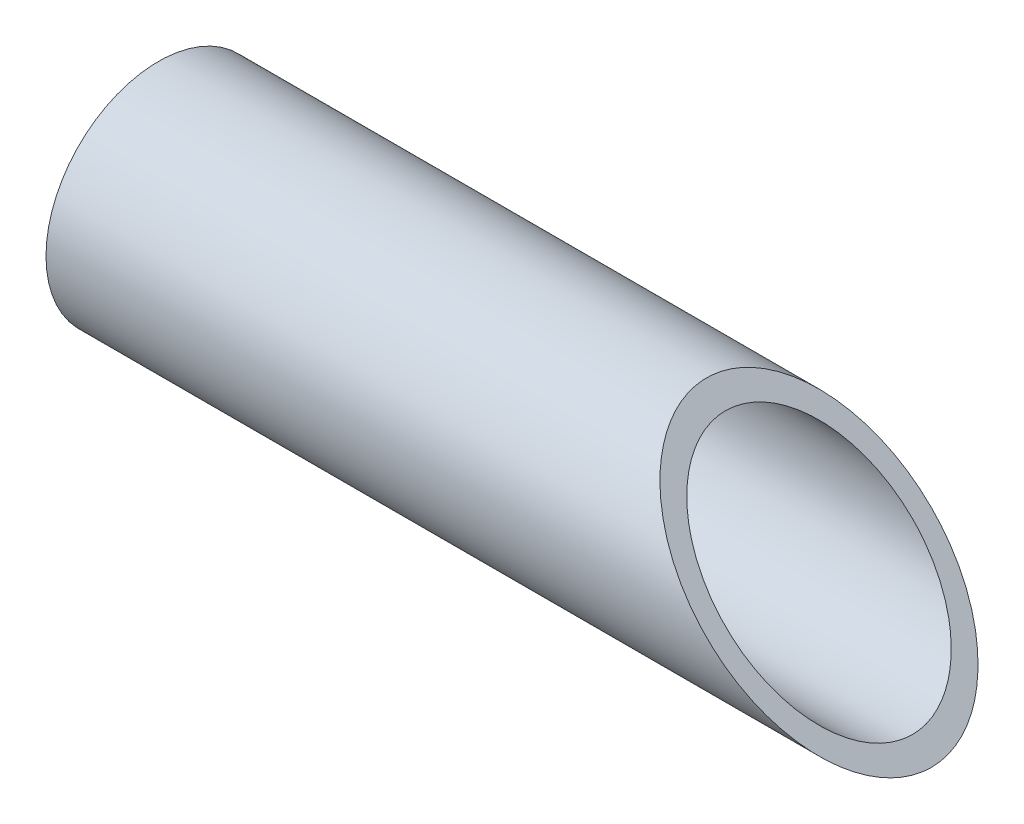
ISO-10303-21;
HEADER;
FILE_DESCRIPTION(('STEP AP214'),'2;1');
FILE_NAME('part.step','',(''),(''),'','','');
FILE_SCHEMA(('AUTOMOTIVE_DESIGN { 1 0 10303 214 1 1 1 1 }'));
ENDSEC;
DATA;
#1=APPLICATION_CONTEXT('core data for automotive mechanical design processes');
#2=APPLICATION_PROTOCOL_DEFINITION('international standard','automotive_design',2000,#1);
#3=PRODUCT_CONTEXT('',#1,'mechanical');
#4=PRODUCT('Part','Part','',(#3));
#5=PRODUCT_RELATED_PRODUCT_CATEGORY('part','',(#4));
#6=PRODUCT_DEFINITION_FORMATION('','',#4);
#7=PRODUCT_DEFINITION_CONTEXT('part definition',#1,'design');
#8=PRODUCT_DEFINITION('design','',#6,#7);
#9=PRODUCT_DEFINITION_SHAPE('','',#8);
#10=(LENGTH_UNIT() NAMED_UNIT(*) SI_UNIT(.MILLI.,.METRE.));
#11=(NAMED_UNIT(*) PLANE_ANGLE_UNIT() SI_UNIT($,.RADIAN.));
#12=(NAMED_UNIT(*) SI_UNIT($,.STERADIAN.) SOLID_ANGLE_UNIT());
#13=UNCERTAINTY_MEASURE_WITH_UNIT(LENGTH_MEASURE(1.E-05),#10,'distance_accuracy_value','');
#14=(GEOMETRIC_REPRESENTATION_CONTEXT(3) GLOBAL_UNCERTAINTY_ASSIGNED_CONTEXT((#13)) GLOBAL_UNIT_ASSIGNED_CONTEXT((#10,
#11,#12)) REPRESENTATION_CONTEXT('',''));
#15=CARTESIAN_POINT('',(0.,0.,0.));
#16=DIRECTION('',(0.,0.,1.));
#17=DIRECTION('',(1.,0.,0.));
#18=AXIS2_PLACEMENT_3D('',#15,#16,#17);
#19=CARTESIAN_POINT('',(144.907,-240.124225616455,26.4651570469141));
#20=DIRECTION('',(1.,0.,0.));
#21=DIRECTION('',(0.,0.,-1.));
#22=AXIS2_PLACEMENT_3D('',#19,#20,#21);
#23=CYLINDRICAL_SURFACE('',#22,17.526);
#24=CARTESIAN_POINT('',(123.825,-240.124225616455,26.4651570469141));
#25=DIRECTION('',(0.707106781186548,0.707106781186548,0.));
#26=DIRECTION('',(0.707106781186548,-0.707106781186548,0.));
#27=AXIS2_PLACEMENT_3D('',#24,#25,#26);
#28=ELLIPSE('',#27,24.7855068941509,17.526);
#29=CARTESIAN_POINT('',(141.351,-257.650225616455,26.4651570469141));
#30=VERTEX_POINT('',#29);
#31=EDGE_CURVE('E24',#30,#30,#28,.F.);
#32=ORIENTED_EDGE('',*,*,#31,.F.);
#33=EDGE_LOOP('',(#32));
#34=FACE_BOUND('',#33,.T.);
#35=CARTESIAN_POINT('',(0.,-240.124225616455,26.4651570469141));
#36=DIRECTION('',(1.,0.,0.));
#37=DIRECTION('',(0.,0.,-1.));
#38=AXIS2_PLACEMENT_3D('',#35,#36,#37);
#39=CIRCLE('',#38,17.526);
#40=CARTESIAN_POINT('',(0.,-240.124225616455,8.9391570469141));
#41=VERTEX_POINT('',#40);
#42=EDGE_CURVE('E15',#41,#41,#39,.F.);
#43=ORIENTED_EDGE('',*,*,#42,.T.);
#44=EDGE_LOOP('',(#43));
#45=FACE_BOUND('',#44,.T.);
#46=ADVANCED_FACE('F12',(#34,#45),#23,.F.);
#47=CARTESIAN_POINT('',(0.,-240.124225616455,26.4651570469141));
#48=DIRECTION('',(1.,0.,0.));
#49=DIRECTION('',(0.,0.,-1.));
#50=AXIS2_PLACEMENT_3D('',#47,#48,#49);
#51=PLANE('',#50);
#52=CARTESIAN_POINT('',(0.,-240.124225616455,26.4651570469141));
#53=DIRECTION('',(1.,0.,0.));
#54=DIRECTION('',(0.,0.,-1.));
#55=AXIS2_PLACEMENT_3D('',#52,#53,#54);
#56=CIRCLE('',#55,21.082);
#57=CARTESIAN_POINT('',(0.,-240.124225616455,5.3831570469141));
#58=VERTEX_POINT('',#57);
#59=EDGE_CURVE('E19',#58,#58,#56,.T.);
#60=ORIENTED_EDGE('',*,*,#59,.F.);
#61=EDGE_LOOP('',(#60));
#62=FACE_BOUND('',#61,.T.);
#63=ORIENTED_EDGE('',*,*,#42,.F.);
#64=EDGE_LOOP('',(#63));
#65=FACE_BOUND('',#64,.T.);
#66=ADVANCED_FACE('F33',(#62,#65),#51,.F.);
#67=CARTESIAN_POINT('',(124.438167287171,-240.737392903626,1523.86962931172));
#68=DIRECTION('',(0.707106781186548,0.707106781186548,0.));
#69=DIRECTION('',(-0.707106781186548,0.707106781186548,0.));
#70=AXIS2_PLACEMENT_3D('',#67,#68,#69);
#71=PLANE('',#70);
#72=CARTESIAN_POINT('',(123.825,-240.124225616455,26.4651570469141));
#73=DIRECTION('',(0.707106781186548,0.707106781186548,0.));
#74=DIRECTION('',(0.707106781186548,-0.707106781186548,0.));
#75=AXIS2_PLACEMENT_3D('',#72,#73,#74);
#76=ELLIPSE('',#75,29.8144503219496,21.082);
#77=CARTESIAN_POINT('',(144.907,-261.206225616455,26.4651570469141));
#78=VERTEX_POINT('',#77);
#79=EDGE_CURVE('E8',#78,#78,#76,.F.);
#80=ORIENTED_EDGE('',*,*,#79,.F.);
#81=EDGE_LOOP('',(#80));
#82=FACE_BOUND('',#81,.T.);
#83=ORIENTED_EDGE('',*,*,#31,.T.);
#84=EDGE_LOOP('',(#83));
#85=FACE_BOUND('',#84,.T.);
#86=ADVANCED_FACE('F35',(#82,#85),#71,.T.);
#87=CARTESIAN_POINT('',(144.907,-240.124225616455,26.4651570469141));
#88=DIRECTION('',(1.,0.,0.));
#89=DIRECTION('',(0.,0.,-1.));
#90=AXIS2_PLACEMENT_3D('',#87,#88,#89);
#91=CYLINDRICAL_SURFACE('',#90,21.082);
#92=ORIENTED_EDGE('',*,*,#79,.T.);
#93=EDGE_LOOP('',(#92));
#94=FACE_BOUND('',#93,.T.);
#95=ORIENTED_EDGE('',*,*,#59,.T.);
#96=EDGE_LOOP('',(#95));
#97=FACE_BOUND('',#96,.T.);
#98=ADVANCED_FACE('F42',(#94,#97),#91,.T.);
#99=CLOSED_SHELL('',(#46,#66,#86,#98));
#100=MANIFOLD_SOLID_BREP('B1',#99);
#101=ADVANCED_BREP_SHAPE_REPRESENTATION('',(#18,#100),#14);
#102=SHAPE_DEFINITION_REPRESENTATION(#9,#101);
ENDSEC;
END-ISO-10303-21;
